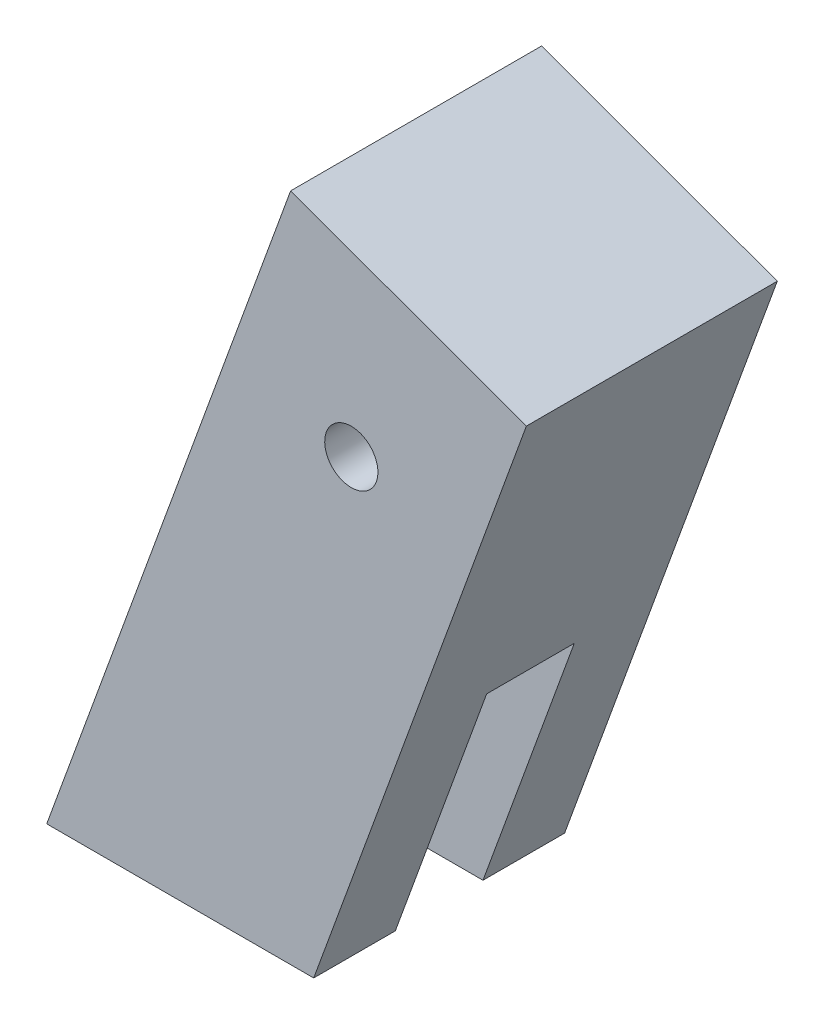
ISO-10303-21;
HEADER;
FILE_DESCRIPTION(('STEP AP214'),'2;1');
FILE_NAME('part.step','',(''),(''),'','','');
FILE_SCHEMA(('AUTOMOTIVE_DESIGN { 1 0 10303 214 1 1 1 1 }'));
ENDSEC;
DATA;
#1=APPLICATION_CONTEXT('core data for automotive mechanical design processes');
#2=APPLICATION_PROTOCOL_DEFINITION('international standard','automotive_design',2000,#1);
#3=PRODUCT_CONTEXT('',#1,'mechanical');
#4=PRODUCT('Part','Part','',(#3));
#5=PRODUCT_RELATED_PRODUCT_CATEGORY('part','',(#4));
#6=PRODUCT_DEFINITION_FORMATION('','',#4);
#7=PRODUCT_DEFINITION_CONTEXT('part definition',#1,'design');
#8=PRODUCT_DEFINITION('design','',#6,#7);
#9=PRODUCT_DEFINITION_SHAPE('','',#8);
#10=(LENGTH_UNIT() NAMED_UNIT(*) SI_UNIT(.MILLI.,.METRE.));
#11=(NAMED_UNIT(*) PLANE_ANGLE_UNIT() SI_UNIT($,.RADIAN.));
#12=(NAMED_UNIT(*) SI_UNIT($,.STERADIAN.) SOLID_ANGLE_UNIT());
#13=UNCERTAINTY_MEASURE_WITH_UNIT(LENGTH_MEASURE(1.E-05),#10,'distance_accuracy_value','');
#14=(GEOMETRIC_REPRESENTATION_CONTEXT(3) GLOBAL_UNCERTAINTY_ASSIGNED_CONTEXT((#13)) GLOBAL_UNIT_ASSIGNED_CONTEXT((#10,
#11,#12)) REPRESENTATION_CONTEXT('',''));
#15=CARTESIAN_POINT('',(0.,0.,0.));
#16=DIRECTION('',(0.,0.,1.));
#17=DIRECTION('',(1.,0.,0.));
#18=AXIS2_PLACEMENT_3D('',#15,#16,#17);
#19=CARTESIAN_POINT('',(0.,0.,0.));
#20=DIRECTION('',(0.,1.,0.));
#21=DIRECTION('',(0.,0.,1.));
#22=AXIS2_PLACEMENT_3D('',#19,#20,#21);
#23=PLANE('',#22);
#24=DIRECTION('',(0.,0.,-1.));
#25=VECTOR('',#24,1.);
#26=CARTESIAN_POINT('',(-10.1362932828331,0.,-9.525));
#27=LINE('',#26,#25);
#28=CARTESIAN_POINT('',(-10.1362932828331,0.,9.525));
#29=VERTEX_POINT('',#28);
#30=CARTESIAN_POINT('',(-10.1362932828331,0.,3.32740000000001));
#31=VERTEX_POINT('',#30);
#32=EDGE_CURVE('E52',#29,#31,#27,.T.);
#33=ORIENTED_EDGE('',*,*,#32,.T.);
#34=DIRECTION('',(-1.,0.,0.));
#35=VECTOR('',#34,1.);
#36=CARTESIAN_POINT('',(34.4295501284019,0.,3.32740000000001));
#37=LINE('',#36,#35);
#38=CARTESIAN_POINT('',(10.1362932828331,0.,3.32740000000001));
#39=VERTEX_POINT('',#38);
#40=EDGE_CURVE('E113',#39,#31,#37,.T.);
#41=ORIENTED_EDGE('',*,*,#40,.F.);
#42=DIRECTION('',(0.,0.,1.));
#43=VECTOR('',#42,1.);
#44=CARTESIAN_POINT('',(10.1362932828331,0.,-9.525));
#45=LINE('',#44,#43);
#46=CARTESIAN_POINT('',(10.1362932828331,0.,9.525));
#47=VERTEX_POINT('',#46);
#48=EDGE_CURVE('E123',#39,#47,#45,.T.);
#49=ORIENTED_EDGE('',*,*,#48,.T.);
#50=DIRECTION('',(-1.,0.,0.));
#51=VECTOR('',#50,1.);
#52=CARTESIAN_POINT('',(-0.55938940169234,0.,9.525));
#53=LINE('',#52,#51);
#54=EDGE_CURVE('E13',#47,#29,#53,.T.);
#55=ORIENTED_EDGE('',*,*,#54,.T.);
#56=EDGE_LOOP('',(#33,#41,#49,#55));
#57=FACE_BOUND('',#56,.T.);
#58=ADVANCED_FACE('F44',(#57),#23,.F.);
#59=CARTESIAN_POINT('',(-18.4605338276639,-22.870662931031,-9.525));
#60=DIRECTION('',(-0.939692620785907,0.342020143325673,0.));
#61=DIRECTION('',(-0.342020143325673,-0.939692620785907,0.));
#62=AXIS2_PLACEMENT_3D('',#59,#60,#61);
#63=PLANE('',#62);
#64=DIRECTION('',(0.342020143325673,0.939692620785907,0.));
#65=VECTOR('',#64,1.);
#66=CARTESIAN_POINT('',(-18.4605338276639,-22.8706629310309,3.32740000000003));
#67=LINE('',#66,#65);
#68=CARTESIAN_POINT('',(-3.20266032006183,19.05,3.32739999999999));
#69=VERTEX_POINT('',#68);
#70=EDGE_CURVE('E177',#31,#69,#67,.T.);
#71=ORIENTED_EDGE('',*,*,#70,.F.);
#72=ORIENTED_EDGE('',*,*,#32,.F.);
#73=DIRECTION('',(0.342020143325672,0.939692620785907,0.));
#74=VECTOR('',#73,1.);
#75=CARTESIAN_POINT('',(-18.4605338276639,-22.870662931031,9.525));
#76=LINE('',#75,#74);
#77=CARTESIAN_POINT('',(8.38351019394234,50.882741865177,9.525));
#78=VERTEX_POINT('',#77);
#79=EDGE_CURVE('E154',#29,#78,#76,.T.);
#80=ORIENTED_EDGE('',*,*,#79,.T.);
#81=DIRECTION('',(0.,0.,1.));
#82=VECTOR('',#81,1.);
#83=CARTESIAN_POINT('',(8.38351019394234,50.882741865177,-9.525));
#84=LINE('',#83,#82);
#85=CARTESIAN_POINT('',(8.38351019394234,50.882741865177,-9.525));
#86=VERTEX_POINT('',#85);
#87=EDGE_CURVE('E143',#86,#78,#84,.T.);
#88=ORIENTED_EDGE('',*,*,#87,.F.);
#89=DIRECTION('',(0.342020143325672,0.939692620785907,0.));
#90=VECTOR('',#89,1.);
#91=CARTESIAN_POINT('',(-18.4605338276639,-22.870662931031,-9.525));
#92=LINE('',#91,#90);
#93=CARTESIAN_POINT('',(-10.1362932828331,0.,-9.525));
#94=VERTEX_POINT('',#93);
#95=EDGE_CURVE('E132',#94,#86,#92,.T.);
#96=ORIENTED_EDGE('',*,*,#95,.F.);
#97=CARTESIAN_POINT('',(-10.1362932828331,0.,-3.32740000000001));
#98=VERTEX_POINT('',#97);
#99=EDGE_CURVE('E141',#98,#94,#27,.T.);
#100=ORIENTED_EDGE('',*,*,#99,.F.);
#101=DIRECTION('',(-0.342020143325673,-0.939692620785907,0.));
#102=VECTOR('',#101,1.);
#103=CARTESIAN_POINT('',(-18.4605338276639,-22.870662931031,-3.32740000000001));
#104=LINE('',#103,#102);
#105=CARTESIAN_POINT('',(-3.20266032006183,19.05,-3.32740000000001));
#106=VERTEX_POINT('',#105);
#107=EDGE_CURVE('E59',#106,#98,#104,.T.);
#108=ORIENTED_EDGE('',*,*,#107,.F.);
#109=DIRECTION('',(0.,0.,-1.));
#110=VECTOR('',#109,1.);
#111=CARTESIAN_POINT('',(-3.20266032006184,19.05,-9.52500000000001));
#112=LINE('',#111,#110);
#113=EDGE_CURVE('E184',#69,#106,#112,.T.);
#114=ORIENTED_EDGE('',*,*,#113,.F.);
#115=EDGE_LOOP('',(#71,#72,#80,#88,#96,#100,#108,#114));
#116=FACE_BOUND('',#115,.T.);
#117=ADVANCED_FACE('F46',(#116),#63,.T.);
#118=CARTESIAN_POINT('',(-0.55938940169234,-29.386146661385,-9.525));
#119=DIRECTION('',(0.,0.,-1.));
#120=DIRECTION('',(-1.,0.,0.));
#121=AXIS2_PLACEMENT_3D('',#118,#119,#120);
#122=PLANE('',#121);
#123=CARTESIAN_POINT('',(12.9904265866921,35.690903716019,-9.525));
#124=DIRECTION('',(0.,0.,-1.));
#125=DIRECTION('',(0.,1.,0.));
#126=AXIS2_PLACEMENT_3D('',#123,#124,#125);
#127=CIRCLE('',#126,2.01929999999999);
#128=CARTESIAN_POINT('',(12.9904265866921,37.710203716019,-9.525));
#129=VERTEX_POINT('',#128);
#130=EDGE_CURVE('E185',#129,#129,#127,.T.);
#131=ORIENTED_EDGE('',*,*,#130,.F.);
#132=EDGE_LOOP('',(#131));
#133=FACE_BOUND('',#132,.T.);
#134=DIRECTION('',(1.,0.,0.));
#135=VECTOR('',#134,1.);
#136=CARTESIAN_POINT('',(-0.55938940169234,0.,-9.525));
#137=LINE('',#136,#135);
#138=CARTESIAN_POINT('',(10.1362932828331,0.,-9.525));
#139=VERTEX_POINT('',#138);
#140=EDGE_CURVE('E68',#94,#139,#137,.T.);
#141=ORIENTED_EDGE('',*,*,#140,.F.);
#142=ORIENTED_EDGE('',*,*,#95,.T.);
#143=DIRECTION('',(-0.939692620785907,0.342020143325672,0.));
#144=VECTOR('',#143,1.);
#145=CARTESIAN_POINT('',(26.2846546199139,44.367258134823,-9.525));
#146=LINE('',#145,#144);
#147=CARTESIAN_POINT('',(26.2846546199139,44.367258134823,-9.525));
#148=VERTEX_POINT('',#147);
#149=EDGE_CURVE('E152',#148,#86,#146,.T.);
#150=ORIENTED_EDGE('',*,*,#149,.F.);
#151=DIRECTION('',(0.342020143325672,0.939692620785907,0.));
#152=VECTOR('',#151,1.);
#153=CARTESIAN_POINT('',(-0.55938940169234,-29.386146661385,-9.525));
#154=LINE('',#153,#152);
#155=EDGE_CURVE('E134',#139,#148,#154,.T.);
#156=ORIENTED_EDGE('',*,*,#155,.F.);
#157=EDGE_LOOP('',(#141,#142,#150,#156));
#158=FACE_BOUND('',#157,.T.);
#159=ADVANCED_FACE('F169',(#133,#158),#122,.T.);
#160=CARTESIAN_POINT('',(-0.55938940169234,-29.386146661385,-9.525));
#161=DIRECTION('',(0.939692620785907,-0.342020143325672,0.));
#162=DIRECTION('',(0.342020143325672,0.939692620785907,0.));
#163=AXIS2_PLACEMENT_3D('',#160,#161,#162);
#164=PLANE('',#163);
#165=DIRECTION('',(0.342020143325672,0.939692620785907,0.));
#166=VECTOR('',#165,1.);
#167=CARTESIAN_POINT('',(12.9780644997125,7.80770224963224,3.3274));
#168=LINE('',#167,#166);
#169=CARTESIAN_POINT('',(17.0699262456043,19.05,3.32739999999999));
#170=VERTEX_POINT('',#169);
#171=EDGE_CURVE('E110',#39,#170,#168,.T.);
#172=ORIENTED_EDGE('',*,*,#171,.T.);
#173=DIRECTION('',(0.,0.,-1.));
#174=VECTOR('',#173,1.);
#175=CARTESIAN_POINT('',(17.0699262456043,19.05,-3.32740000000001));
#176=LINE('',#175,#174);
#177=CARTESIAN_POINT('',(17.0699262456043,19.05,-3.32740000000001));
#178=VERTEX_POINT('',#177);
#179=EDGE_CURVE('E260',#170,#178,#176,.T.);
#180=ORIENTED_EDGE('',*,*,#179,.T.);
#181=DIRECTION('',(-0.342020143325672,-0.939692620785907,0.));
#182=VECTOR('',#181,1.);
#183=CARTESIAN_POINT('',(12.9780644997125,7.80770224963224,-3.32740000000001));
#184=LINE('',#183,#182);
#185=CARTESIAN_POINT('',(10.1362932828331,0.,-3.32740000000001));
#186=VERTEX_POINT('',#185);
#187=EDGE_CURVE('E175',#178,#186,#184,.T.);
#188=ORIENTED_EDGE('',*,*,#187,.T.);
#189=EDGE_CURVE('E131',#139,#186,#45,.T.);
#190=ORIENTED_EDGE('',*,*,#189,.F.);
#191=ORIENTED_EDGE('',*,*,#155,.T.);
#192=DIRECTION('',(0.,0.,-1.));
#193=VECTOR('',#192,1.);
#194=CARTESIAN_POINT('',(26.2846546199139,44.367258134823,-9.525));
#195=LINE('',#194,#193);
#196=CARTESIAN_POINT('',(26.2846546199139,44.367258134823,9.525));
#197=VERTEX_POINT('',#196);
#198=EDGE_CURVE('E149',#197,#148,#195,.T.);
#199=ORIENTED_EDGE('',*,*,#198,.F.);
#200=DIRECTION('',(0.342020143325672,0.939692620785907,0.));
#201=VECTOR('',#200,1.);
#202=CARTESIAN_POINT('',(-0.55938940169234,-29.386146661385,9.525));
#203=LINE('',#202,#201);
#204=EDGE_CURVE('E129',#47,#197,#203,.T.);
#205=ORIENTED_EDGE('',*,*,#204,.F.);
#206=ORIENTED_EDGE('',*,*,#48,.F.);
#207=EDGE_LOOP('',(#172,#180,#188,#190,#191,#199,#205,#206));
#208=FACE_BOUND('',#207,.T.);
#209=ADVANCED_FACE('F127',(#208),#164,.T.);
#210=CARTESIAN_POINT('',(-0.55938940169234,-29.386146661385,9.525));
#211=DIRECTION('',(0.,0.,1.));
#212=DIRECTION('',(1.,0.,0.));
#213=AXIS2_PLACEMENT_3D('',#210,#211,#212);
#214=PLANE('',#213);
#215=CARTESIAN_POINT('',(12.9904265866921,35.690903716019,9.525));
#216=DIRECTION('',(0.,0.,-1.));
#217=DIRECTION('',(0.,1.,0.));
#218=AXIS2_PLACEMENT_3D('',#215,#216,#217);
#219=CIRCLE('',#218,2.01929999999999);
#220=CARTESIAN_POINT('',(12.9904265866921,37.710203716019,9.525));
#221=VERTEX_POINT('',#220);
#222=EDGE_CURVE('E138',#221,#221,#219,.T.);
#223=ORIENTED_EDGE('',*,*,#222,.T.);
#224=EDGE_LOOP('',(#223));
#225=FACE_BOUND('',#224,.T.);
#226=ORIENTED_EDGE('',*,*,#54,.F.);
#227=ORIENTED_EDGE('',*,*,#204,.T.);
#228=DIRECTION('',(0.939692620785907,-0.342020143325672,0.));
#229=VECTOR('',#228,1.);
#230=CARTESIAN_POINT('',(26.2846546199139,44.367258134823,9.525));
#231=LINE('',#230,#229);
#232=EDGE_CURVE('E146',#78,#197,#231,.T.);
#233=ORIENTED_EDGE('',*,*,#232,.F.);
#234=ORIENTED_EDGE('',*,*,#79,.F.);
#235=EDGE_LOOP('',(#226,#227,#233,#234));
#236=FACE_BOUND('',#235,.T.);
#237=ADVANCED_FACE('F163',(#225,#236),#214,.T.);
#238=CARTESIAN_POINT('',(17.3340824069281,47.625,0.));
#239=DIRECTION('',(-0.342020143325672,-0.939692620785907,0.));
#240=DIRECTION('',(0.939692620785907,-0.342020143325672,0.));
#241=AXIS2_PLACEMENT_3D('',#238,#239,#240);
#242=PLANE('',#241);
#243=ORIENTED_EDGE('',*,*,#87,.T.);
#244=ORIENTED_EDGE('',*,*,#232,.T.);
#245=ORIENTED_EDGE('',*,*,#198,.T.);
#246=ORIENTED_EDGE('',*,*,#149,.T.);
#247=EDGE_LOOP('',(#243,#244,#245,#246));
#248=FACE_BOUND('',#247,.T.);
#249=ADVANCED_FACE('F165',(#248),#242,.F.);
#250=ORIENTED_EDGE('',*,*,#189,.T.);
#251=DIRECTION('',(-1.,0.,0.));
#252=VECTOR('',#251,1.);
#253=CARTESIAN_POINT('',(34.4295501284019,0.,-3.32740000000001));
#254=LINE('',#253,#252);
#255=EDGE_CURVE('E173',#186,#98,#254,.T.);
#256=ORIENTED_EDGE('',*,*,#255,.T.);
#257=ORIENTED_EDGE('',*,*,#99,.T.);
#258=ORIENTED_EDGE('',*,*,#140,.T.);
#259=EDGE_LOOP('',(#250,#256,#257,#258));
#260=FACE_BOUND('',#259,.T.);
#261=ADVANCED_FACE('F172',(#260),#23,.F.);
#262=CARTESIAN_POINT('',(12.9904265866921,35.690903716019,-9.525));
#263=DIRECTION('',(0.,0.,-1.));
#264=DIRECTION('',(0.,1.,0.));
#265=AXIS2_PLACEMENT_3D('',#262,#263,#264);
#266=CYLINDRICAL_SURFACE('',#265,2.01929999999999);
#267=ORIENTED_EDGE('',*,*,#222,.F.);
#268=EDGE_LOOP('',(#267));
#269=FACE_BOUND('',#268,.T.);
#270=ORIENTED_EDGE('',*,*,#130,.T.);
#271=EDGE_LOOP('',(#270));
#272=FACE_BOUND('',#271,.T.);
#273=ADVANCED_FACE('F193',(#269,#272),#266,.F.);
#274=CARTESIAN_POINT('',(34.4295501284019,0.,3.32740000000001));
#275=DIRECTION('',(0.,0.,1.));
#276=DIRECTION('',(0.,-1.,0.));
#277=AXIS2_PLACEMENT_3D('',#274,#275,#276);
#278=PLANE('',#277);
#279=ORIENTED_EDGE('',*,*,#70,.T.);
#280=DIRECTION('',(-1.,0.,0.));
#281=VECTOR('',#280,1.);
#282=CARTESIAN_POINT('',(34.4295501284019,19.05,3.32739999999999));
#283=LINE('',#282,#281);
#284=EDGE_CURVE('E116',#170,#69,#283,.T.);
#285=ORIENTED_EDGE('',*,*,#284,.F.);
#286=ORIENTED_EDGE('',*,*,#171,.F.);
#287=ORIENTED_EDGE('',*,*,#40,.T.);
#288=EDGE_LOOP('',(#279,#285,#286,#287));
#289=FACE_BOUND('',#288,.T.);
#290=ADVANCED_FACE('F112',(#289),#278,.F.);
#291=CARTESIAN_POINT('',(34.4295501284019,19.05,-3.32740000000001));
#292=DIRECTION('',(0.,1.,0.));
#293=DIRECTION('',(-1.,0.,0.));
#294=AXIS2_PLACEMENT_3D('',#291,#292,#293);
#295=PLANE('',#294);
#296=ORIENTED_EDGE('',*,*,#113,.T.);
#297=DIRECTION('',(-1.,0.,0.));
#298=VECTOR('',#297,1.);
#299=CARTESIAN_POINT('',(34.4295501284019,19.05,-3.32740000000001));
#300=LINE('',#299,#298);
#301=EDGE_CURVE('E179',#178,#106,#300,.T.);
#302=ORIENTED_EDGE('',*,*,#301,.F.);
#303=ORIENTED_EDGE('',*,*,#179,.F.);
#304=ORIENTED_EDGE('',*,*,#284,.T.);
#305=EDGE_LOOP('',(#296,#302,#303,#304));
#306=FACE_BOUND('',#305,.T.);
#307=ADVANCED_FACE('F200',(#306),#295,.F.);
#308=CARTESIAN_POINT('',(34.4295501284019,0.,-3.32740000000001));
#309=DIRECTION('',(0.,0.,-1.));
#310=DIRECTION('',(-1.,0.,0.));
#311=AXIS2_PLACEMENT_3D('',#308,#309,#310);
#312=PLANE('',#311);
#313=ORIENTED_EDGE('',*,*,#107,.T.);
#314=ORIENTED_EDGE('',*,*,#255,.F.);
#315=ORIENTED_EDGE('',*,*,#187,.F.);
#316=ORIENTED_EDGE('',*,*,#301,.T.);
#317=EDGE_LOOP('',(#313,#314,#315,#316));
#318=FACE_BOUND('',#317,.T.);
#319=ADVANCED_FACE('F246',(#318),#312,.F.);
#320=CLOSED_SHELL('',(#58,#117,#159,#209,#237,#249,#261,#273,#290,#307,#319));
#321=MANIFOLD_SOLID_BREP('B2',#320);
#322=ADVANCED_BREP_SHAPE_REPRESENTATION('',(#18,#321),#14);
#323=SHAPE_DEFINITION_REPRESENTATION(#9,#322);
ENDSEC;
END-ISO-10303-21;
